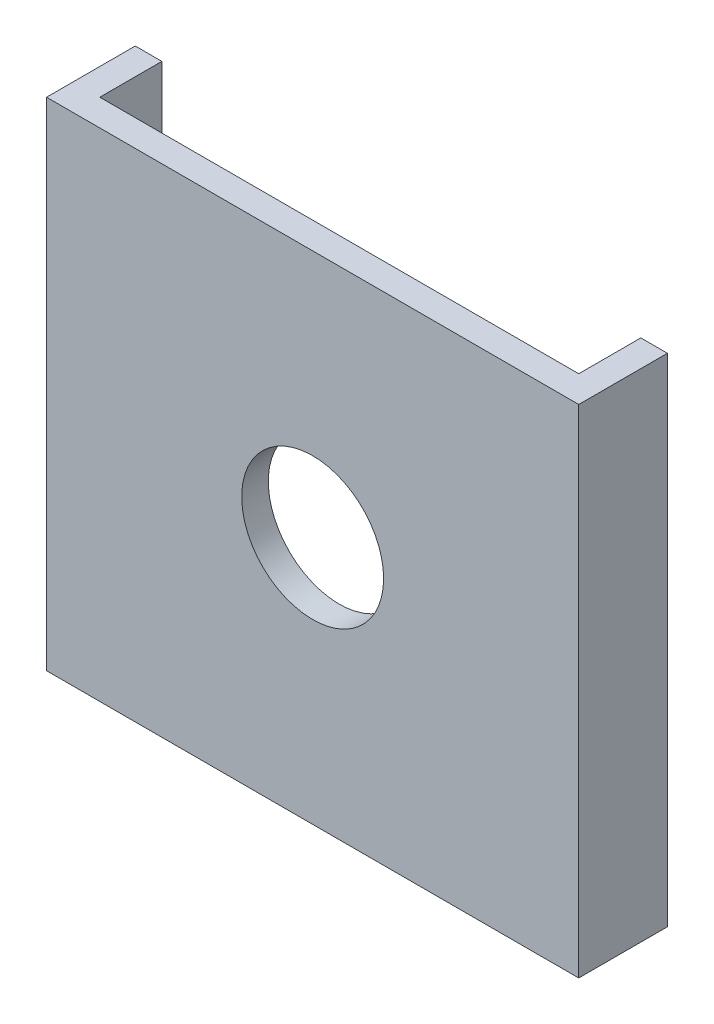
ISO-10303-21;
HEADER;
FILE_DESCRIPTION(('STEP AP214'),'2;1');
FILE_NAME('part.step','',(''),(''),'','','');
FILE_SCHEMA(('AUTOMOTIVE_DESIGN { 1 0 10303 214 1 1 1 1 }'));
ENDSEC;
DATA;
#1=APPLICATION_CONTEXT('core data for automotive mechanical design processes');
#2=APPLICATION_PROTOCOL_DEFINITION('international standard','automotive_design',2000,#1);
#3=PRODUCT_CONTEXT('',#1,'mechanical');
#4=PRODUCT('Part','Part','',(#3));
#5=PRODUCT_RELATED_PRODUCT_CATEGORY('part','',(#4));
#6=PRODUCT_DEFINITION_FORMATION('','',#4);
#7=PRODUCT_DEFINITION_CONTEXT('part definition',#1,'design');
#8=PRODUCT_DEFINITION('design','',#6,#7);
#9=PRODUCT_DEFINITION_SHAPE('','',#8);
#10=(LENGTH_UNIT() NAMED_UNIT(*) SI_UNIT(.MILLI.,.METRE.));
#11=(NAMED_UNIT(*) PLANE_ANGLE_UNIT() SI_UNIT($,.RADIAN.));
#12=(NAMED_UNIT(*) SI_UNIT($,.STERADIAN.) SOLID_ANGLE_UNIT());
#13=UNCERTAINTY_MEASURE_WITH_UNIT(LENGTH_MEASURE(1.E-05),#10,'distance_accuracy_value','');
#14=(GEOMETRIC_REPRESENTATION_CONTEXT(3) GLOBAL_UNCERTAINTY_ASSIGNED_CONTEXT((#13)) GLOBAL_UNIT_ASSIGNED_CONTEXT((#10,
#11,#12)) REPRESENTATION_CONTEXT('',''));
#15=CARTESIAN_POINT('',(0.,0.,0.));
#16=DIRECTION('',(0.,0.,1.));
#17=DIRECTION('',(1.,0.,0.));
#18=AXIS2_PLACEMENT_3D('',#15,#16,#17);
#19=CARTESIAN_POINT('',(-13.5,9.,-5.));
#20=DIRECTION('',(0.,-1.,0.));
#21=DIRECTION('',(0.,0.,-1.));
#22=AXIS2_PLACEMENT_3D('',#19,#20,#21);
#23=PLANE('',#22);
#24=DIRECTION('',(0.,0.,1.));
#25=VECTOR('',#24,1.);
#26=CARTESIAN_POINT('',(-15.,9.,-5.));
#27=LINE('',#26,#25);
#28=CARTESIAN_POINT('',(-15.,9.,-8.));
#29=VERTEX_POINT('',#28);
#30=CARTESIAN_POINT('',(-15.,9.,-5.));
#31=VERTEX_POINT('',#30);
#32=EDGE_CURVE('E110',#29,#31,#27,.T.);
#33=ORIENTED_EDGE('',*,*,#32,.F.);
#34=DIRECTION('',(-1.,0.,0.));
#35=VECTOR('',#34,1.);
#36=CARTESIAN_POINT('',(-13.5,9.,-8.));
#37=LINE('',#36,#35);
#38=CARTESIAN_POINT('',(-13.5,9.,-8.));
#39=VERTEX_POINT('',#38);
#40=EDGE_CURVE('E12',#39,#29,#37,.T.);
#41=ORIENTED_EDGE('',*,*,#40,.F.);
#42=DIRECTION('',(0.,0.,1.));
#43=VECTOR('',#42,1.);
#44=CARTESIAN_POINT('',(-13.5,9.,-5.));
#45=LINE('',#44,#43);
#46=CARTESIAN_POINT('',(-13.5,9.,-5.));
#47=VERTEX_POINT('',#46);
#48=EDGE_CURVE('E103',#39,#47,#45,.T.);
#49=ORIENTED_EDGE('',*,*,#48,.T.);
#50=DIRECTION('',(-1.,0.,0.));
#51=VECTOR('',#50,1.);
#52=CARTESIAN_POINT('',(-13.5,9.,-5.));
#53=LINE('',#52,#51);
#54=EDGE_CURVE('E48',#47,#31,#53,.T.);
#55=ORIENTED_EDGE('',*,*,#54,.T.);
#56=EDGE_LOOP('',(#33,#41,#49,#55));
#57=FACE_BOUND('',#56,.T.);
#58=ADVANCED_FACE('F45',(#57),#23,.T.);
#59=CARTESIAN_POINT('',(-13.5,14.,-8.));
#60=DIRECTION('',(-1.,0.,0.));
#61=DIRECTION('',(0.,0.,1.));
#62=AXIS2_PLACEMENT_3D('',#59,#60,#61);
#63=CYLINDRICAL_SURFACE('',#62,5.);
#64=CARTESIAN_POINT('',(-15.,14.,-8.));
#65=DIRECTION('',(-1.,0.,0.));
#66=DIRECTION('',(0.,0.,1.));
#67=AXIS2_PLACEMENT_3D('',#64,#65,#66);
#68=CIRCLE('',#67,5.);
#69=CARTESIAN_POINT('',(-15.,19.,-8.));
#70=VERTEX_POINT('',#69);
#71=EDGE_CURVE('E105',#70,#29,#68,.T.);
#72=ORIENTED_EDGE('',*,*,#71,.F.);
#73=DIRECTION('',(-1.,0.,0.));
#74=VECTOR('',#73,1.);
#75=CARTESIAN_POINT('',(-13.5,19.,-8.));
#76=LINE('',#75,#74);
#77=CARTESIAN_POINT('',(-13.5,19.,-8.));
#78=VERTEX_POINT('',#77);
#79=EDGE_CURVE('E54',#78,#70,#76,.T.);
#80=ORIENTED_EDGE('',*,*,#79,.F.);
#81=CARTESIAN_POINT('',(-13.5,14.,-8.));
#82=DIRECTION('',(-1.,0.,0.));
#83=DIRECTION('',(0.,0.,1.));
#84=AXIS2_PLACEMENT_3D('',#81,#82,#83);
#85=CIRCLE('',#84,5.);
#86=EDGE_CURVE('E100',#78,#39,#85,.T.);
#87=ORIENTED_EDGE('',*,*,#86,.T.);
#88=ORIENTED_EDGE('',*,*,#40,.T.);
#89=EDGE_LOOP('',(#72,#80,#87,#88));
#90=FACE_BOUND('',#89,.T.);
#91=ADVANCED_FACE('F121',(#90),#63,.T.);
#92=CARTESIAN_POINT('',(-13.5,19.,-8.));
#93=DIRECTION('',(0.,1.,0.));
#94=DIRECTION('',(0.,0.,1.));
#95=AXIS2_PLACEMENT_3D('',#92,#93,#94);
#96=PLANE('',#95);
#97=DIRECTION('',(0.,0.,-1.));
#98=VECTOR('',#97,1.);
#99=CARTESIAN_POINT('',(-15.,19.,-8.));
#100=LINE('',#99,#98);
#101=CARTESIAN_POINT('',(-15.,19.,-5.));
#102=VERTEX_POINT('',#101);
#103=EDGE_CURVE('E95',#102,#70,#100,.T.);
#104=ORIENTED_EDGE('',*,*,#103,.F.);
#105=DIRECTION('',(-1.,0.,0.));
#106=VECTOR('',#105,1.);
#107=CARTESIAN_POINT('',(-13.5,19.,-5.));
#108=LINE('',#107,#106);
#109=CARTESIAN_POINT('',(-13.5,19.,-5.));
#110=VERTEX_POINT('',#109);
#111=EDGE_CURVE('E90',#110,#102,#108,.T.);
#112=ORIENTED_EDGE('',*,*,#111,.F.);
#113=DIRECTION('',(0.,0.,-1.));
#114=VECTOR('',#113,1.);
#115=CARTESIAN_POINT('',(-13.5,19.,-8.));
#116=LINE('',#115,#114);
#117=EDGE_CURVE('E93',#110,#78,#116,.T.);
#118=ORIENTED_EDGE('',*,*,#117,.T.);
#119=ORIENTED_EDGE('',*,*,#79,.T.);
#120=EDGE_LOOP('',(#104,#112,#118,#119));
#121=FACE_BOUND('',#120,.T.);
#122=ADVANCED_FACE('F92',(#121),#96,.T.);
#123=CARTESIAN_POINT('',(-13.5,19.,-5.));
#124=DIRECTION('',(0.,0.,1.));
#125=DIRECTION('',(1.,0.,0.));
#126=AXIS2_PLACEMENT_3D('',#123,#124,#125);
#127=PLANE('',#126);
#128=DIRECTION('',(0.,1.,0.));
#129=VECTOR('',#128,1.);
#130=CARTESIAN_POINT('',(-15.,19.,-5.));
#131=LINE('',#130,#129);
#132=EDGE_CURVE('E113',#31,#102,#131,.T.);
#133=ORIENTED_EDGE('',*,*,#132,.F.);
#134=ORIENTED_EDGE('',*,*,#54,.F.);
#135=DIRECTION('',(0.,1.,0.));
#136=VECTOR('',#135,1.);
#137=CARTESIAN_POINT('',(-13.5,19.,-5.));
#138=LINE('',#137,#136);
#139=EDGE_CURVE('E99',#47,#110,#138,.T.);
#140=ORIENTED_EDGE('',*,*,#139,.T.);
#141=ORIENTED_EDGE('',*,*,#111,.T.);
#142=EDGE_LOOP('',(#133,#134,#140,#141));
#143=FACE_BOUND('',#142,.T.);
#144=ADVANCED_FACE('F102',(#143),#127,.T.);
#145=CARTESIAN_POINT('',(-13.5,14.,-8.));
#146=DIRECTION('',(-1.,0.,0.));
#147=DIRECTION('',(0.,0.,1.));
#148=AXIS2_PLACEMENT_3D('',#145,#146,#147);
#149=PLANE('',#148);
#150=CARTESIAN_POINT('',(-13.5,14.,-8.));
#151=DIRECTION('',(1.,0.,0.));
#152=DIRECTION('',(0.,0.,-1.));
#153=AXIS2_PLACEMENT_3D('',#150,#151,#152);
#154=CIRCLE('',#153,1.55);
#155=CARTESIAN_POINT('',(-13.5,14.,-9.55));
#156=VERTEX_POINT('',#155);
#157=EDGE_CURVE('E151',#156,#156,#154,.T.);
#158=ORIENTED_EDGE('',*,*,#157,.F.);
#159=EDGE_LOOP('',(#158));
#160=FACE_BOUND('',#159,.T.);
#161=ORIENTED_EDGE('',*,*,#48,.F.);
#162=ORIENTED_EDGE('',*,*,#86,.F.);
#163=ORIENTED_EDGE('',*,*,#117,.F.);
#164=ORIENTED_EDGE('',*,*,#139,.F.);
#165=EDGE_LOOP('',(#161,#162,#163,#164));
#166=FACE_BOUND('',#165,.T.);
#167=ADVANCED_FACE('F98',(#160,#166),#149,.F.);
#168=CARTESIAN_POINT('',(-15.,14.,-8.));
#169=DIRECTION('',(-1.,0.,0.));
#170=DIRECTION('',(0.,0.,1.));
#171=AXIS2_PLACEMENT_3D('',#168,#169,#170);
#172=PLANE('',#171);
#173=CARTESIAN_POINT('',(-15.,14.,-8.));
#174=DIRECTION('',(1.,0.,0.));
#175=DIRECTION('',(0.,0.,-1.));
#176=AXIS2_PLACEMENT_3D('',#173,#174,#175);
#177=CIRCLE('',#176,1.55);
#178=CARTESIAN_POINT('',(-15.,14.,-9.55));
#179=VERTEX_POINT('',#178);
#180=EDGE_CURVE('E114',#179,#179,#177,.T.);
#181=ORIENTED_EDGE('',*,*,#180,.T.);
#182=EDGE_LOOP('',(#181));
#183=FACE_BOUND('',#182,.T.);
#184=ORIENTED_EDGE('',*,*,#32,.T.);
#185=ORIENTED_EDGE('',*,*,#132,.T.);
#186=ORIENTED_EDGE('',*,*,#103,.T.);
#187=ORIENTED_EDGE('',*,*,#71,.T.);
#188=EDGE_LOOP('',(#184,#185,#186,#187));
#189=FACE_BOUND('',#188,.T.);
#190=ADVANCED_FACE('F120',(#183,#189),#172,.T.);
#191=CARTESIAN_POINT('',(-15.,14.,-8.));
#192=DIRECTION('',(1.,0.,0.));
#193=DIRECTION('',(0.,0.,-1.));
#194=AXIS2_PLACEMENT_3D('',#191,#192,#193);
#195=CYLINDRICAL_SURFACE('',#194,1.55);
#196=ORIENTED_EDGE('',*,*,#180,.F.);
#197=EDGE_LOOP('',(#196));
#198=FACE_BOUND('',#197,.T.);
#199=ORIENTED_EDGE('',*,*,#157,.T.);
#200=EDGE_LOOP('',(#199));
#201=FACE_BOUND('',#200,.T.);
#202=ADVANCED_FACE('F139',(#198,#201),#195,.F.);
#203=CLOSED_SHELL('',(#58,#91,#122,#144,#167,#190,#202));
#204=MANIFOLD_SOLID_BREP('B2',#203);
#205=CARTESIAN_POINT('',(-15.,28.,-5.));
#206=DIRECTION('',(1.,0.,0.));
#207=DIRECTION('',(0.,0.,-1.));
#208=AXIS2_PLACEMENT_3D('',#205,#206,#207);
#209=PLANE('',#208);
#210=DIRECTION('',(0.,0.,1.));
#211=VECTOR('',#210,1.);
#212=CARTESIAN_POINT('',(-15.,0.,-5.));
#213=LINE('',#212,#211);
#214=CARTESIAN_POINT('',(-15.,0.,-5.));
#215=VERTEX_POINT('',#214);
#216=CARTESIAN_POINT('',(-15.,0.,0.));
#217=VERTEX_POINT('',#216);
#218=EDGE_CURVE('E286',#215,#217,#213,.T.);
#219=ORIENTED_EDGE('',*,*,#218,.T.);
#220=DIRECTION('',(0.,-1.,0.));
#221=VECTOR('',#220,1.);
#222=CARTESIAN_POINT('',(-15.,28.,0.));
#223=LINE('',#222,#221);
#224=CARTESIAN_POINT('',(-15.,28.,0.));
#225=VERTEX_POINT('',#224);
#226=EDGE_CURVE('E43',#225,#217,#223,.T.);
#227=ORIENTED_EDGE('',*,*,#226,.F.);
#228=DIRECTION('',(0.,0.,1.));
#229=VECTOR('',#228,1.);
#230=CARTESIAN_POINT('',(-15.,28.,-5.));
#231=LINE('',#230,#229);
#232=CARTESIAN_POINT('',(-15.,28.,-5.));
#233=VERTEX_POINT('',#232);
#234=EDGE_CURVE('E301',#233,#225,#231,.T.);
#235=ORIENTED_EDGE('',*,*,#234,.F.);
#236=DIRECTION('',(0.,-1.,0.));
#237=VECTOR('',#236,1.);
#238=CARTESIAN_POINT('',(-15.,28.,-5.));
#239=LINE('',#238,#237);
#240=EDGE_CURVE('E282',#233,#215,#239,.T.);
#241=ORIENTED_EDGE('',*,*,#240,.T.);
#242=EDGE_LOOP('',(#219,#227,#235,#241));
#243=FACE_BOUND('',#242,.T.);
#244=ADVANCED_FACE('F190',(#243),#209,.F.);
#245=CARTESIAN_POINT('',(-15.,28.,0.));
#246=DIRECTION('',(0.,0.,-1.));
#247=DIRECTION('',(-1.,0.,0.));
#248=AXIS2_PLACEMENT_3D('',#245,#246,#247);
#249=PLANE('',#248);
#250=CARTESIAN_POINT('',(0.,14.,0.));
#251=DIRECTION('',(0.,0.,1.));
#252=DIRECTION('',(1.,0.,0.));
#253=AXIS2_PLACEMENT_3D('',#250,#251,#252);
#254=CIRCLE('',#253,4.);
#255=CARTESIAN_POINT('',(4.,14.,0.));
#256=VERTEX_POINT('',#255);
#257=EDGE_CURVE('E334',#256,#256,#254,.T.);
#258=ORIENTED_EDGE('',*,*,#257,.F.);
#259=EDGE_LOOP('',(#258));
#260=FACE_BOUND('',#259,.T.);
#261=DIRECTION('',(1.,0.,0.));
#262=VECTOR('',#261,1.);
#263=CARTESIAN_POINT('',(-15.,0.,0.));
#264=LINE('',#263,#262);
#265=CARTESIAN_POINT('',(15.,0.,0.));
#266=VERTEX_POINT('',#265);
#267=EDGE_CURVE('E289',#217,#266,#264,.T.);
#268=ORIENTED_EDGE('',*,*,#267,.T.);
#269=DIRECTION('',(0.,-1.,0.));
#270=VECTOR('',#269,1.);
#271=CARTESIAN_POINT('',(15.,28.,0.));
#272=LINE('',#271,#270);
#273=CARTESIAN_POINT('',(15.,28.,0.));
#274=VERTEX_POINT('',#273);
#275=EDGE_CURVE('E198',#274,#266,#272,.T.);
#276=ORIENTED_EDGE('',*,*,#275,.F.);
#277=DIRECTION('',(1.,0.,0.));
#278=VECTOR('',#277,1.);
#279=CARTESIAN_POINT('',(-15.,28.,0.));
#280=LINE('',#279,#278);
#281=EDGE_CURVE('E249',#225,#274,#280,.T.);
#282=ORIENTED_EDGE('',*,*,#281,.F.);
#283=ORIENTED_EDGE('',*,*,#226,.T.);
#284=EDGE_LOOP('',(#268,#276,#282,#283));
#285=FACE_BOUND('',#284,.T.);
#286=ADVANCED_FACE('F347',(#260,#285),#249,.F.);
#287=CARTESIAN_POINT('',(15.,28.,0.));
#288=DIRECTION('',(-1.,0.,0.));
#289=DIRECTION('',(0.,0.,1.));
#290=AXIS2_PLACEMENT_3D('',#287,#288,#289);
#291=PLANE('',#290);
#292=DIRECTION('',(0.,0.,-1.));
#293=VECTOR('',#292,1.);
#294=CARTESIAN_POINT('',(15.,0.,0.));
#295=LINE('',#294,#293);
#296=CARTESIAN_POINT('',(15.,0.,-5.));
#297=VERTEX_POINT('',#296);
#298=EDGE_CURVE('E292',#266,#297,#295,.T.);
#299=ORIENTED_EDGE('',*,*,#298,.T.);
#300=DIRECTION('',(0.,-1.,0.));
#301=VECTOR('',#300,1.);
#302=CARTESIAN_POINT('',(15.,28.,-5.));
#303=LINE('',#302,#301);
#304=CARTESIAN_POINT('',(15.,28.,-5.));
#305=VERTEX_POINT('',#304);
#306=EDGE_CURVE('E308',#305,#297,#303,.T.);
#307=ORIENTED_EDGE('',*,*,#306,.F.);
#308=DIRECTION('',(0.,0.,-1.));
#309=VECTOR('',#308,1.);
#310=CARTESIAN_POINT('',(15.,28.,0.));
#311=LINE('',#310,#309);
#312=EDGE_CURVE('E316',#274,#305,#311,.T.);
#313=ORIENTED_EDGE('',*,*,#312,.F.);
#314=ORIENTED_EDGE('',*,*,#275,.T.);
#315=EDGE_LOOP('',(#299,#307,#313,#314));
#316=FACE_BOUND('',#315,.T.);
#317=ADVANCED_FACE('F314',(#316),#291,.F.);
#318=CARTESIAN_POINT('',(13.5,28.,-5.));
#319=DIRECTION('',(0.,0.,1.));
#320=DIRECTION('',(1.,0.,0.));
#321=AXIS2_PLACEMENT_3D('',#318,#319,#320);
#322=PLANE('',#321);
#323=DIRECTION('',(-1.,0.,0.));
#324=VECTOR('',#323,1.);
#325=CARTESIAN_POINT('',(13.5,0.,-5.));
#326=LINE('',#325,#324);
#327=CARTESIAN_POINT('',(13.5,0.,-5.));
#328=VERTEX_POINT('',#327);
#329=EDGE_CURVE('E294',#297,#328,#326,.T.);
#330=ORIENTED_EDGE('',*,*,#329,.T.);
#331=DIRECTION('',(0.,-1.,0.));
#332=VECTOR('',#331,1.);
#333=CARTESIAN_POINT('',(13.5,28.,-5.));
#334=LINE('',#333,#332);
#335=CARTESIAN_POINT('',(13.5,28.,-5.));
#336=VERTEX_POINT('',#335);
#337=EDGE_CURVE('E305',#336,#328,#334,.T.);
#338=ORIENTED_EDGE('',*,*,#337,.F.);
#339=DIRECTION('',(-1.,0.,0.));
#340=VECTOR('',#339,1.);
#341=CARTESIAN_POINT('',(13.5,28.,-5.));
#342=LINE('',#341,#340);
#343=EDGE_CURVE('E328',#305,#336,#342,.T.);
#344=ORIENTED_EDGE('',*,*,#343,.F.);
#345=ORIENTED_EDGE('',*,*,#306,.T.);
#346=EDGE_LOOP('',(#330,#338,#344,#345));
#347=FACE_BOUND('',#346,.T.);
#348=ADVANCED_FACE('F324',(#347),#322,.F.);
#349=CARTESIAN_POINT('',(13.5,28.,-5.));
#350=DIRECTION('',(1.,0.,0.));
#351=DIRECTION('',(0.,0.,-1.));
#352=AXIS2_PLACEMENT_3D('',#349,#350,#351);
#353=PLANE('',#352);
#354=DIRECTION('',(0.,0.,1.));
#355=VECTOR('',#354,1.);
#356=CARTESIAN_POINT('',(13.5,0.,-5.));
#357=LINE('',#356,#355);
#358=CARTESIAN_POINT('',(13.5,0.,-1.5));
#359=VERTEX_POINT('',#358);
#360=EDGE_CURVE('E296',#328,#359,#357,.T.);
#361=ORIENTED_EDGE('',*,*,#360,.T.);
#362=DIRECTION('',(0.,-1.,0.));
#363=VECTOR('',#362,1.);
#364=CARTESIAN_POINT('',(13.5,28.,-1.5));
#365=LINE('',#364,#363);
#366=CARTESIAN_POINT('',(13.5,28.,-1.5));
#367=VERTEX_POINT('',#366);
#368=EDGE_CURVE('E277',#367,#359,#365,.T.);
#369=ORIENTED_EDGE('',*,*,#368,.F.);
#370=DIRECTION('',(0.,0.,1.));
#371=VECTOR('',#370,1.);
#372=CARTESIAN_POINT('',(13.5,28.,-5.));
#373=LINE('',#372,#371);
#374=EDGE_CURVE('E268',#336,#367,#373,.T.);
#375=ORIENTED_EDGE('',*,*,#374,.F.);
#376=ORIENTED_EDGE('',*,*,#337,.T.);
#377=EDGE_LOOP('',(#361,#369,#375,#376));
#378=FACE_BOUND('',#377,.T.);
#379=ADVANCED_FACE('F327',(#378),#353,.F.);
#380=CARTESIAN_POINT('',(13.5,28.,-1.5));
#381=DIRECTION('',(0.,0.,1.));
#382=DIRECTION('',(1.,0.,0.));
#383=AXIS2_PLACEMENT_3D('',#380,#381,#382);
#384=PLANE('',#383);
#385=CARTESIAN_POINT('',(0.,14.,-1.5));
#386=DIRECTION('',(0.,0.,1.));
#387=DIRECTION('',(1.,0.,0.));
#388=AXIS2_PLACEMENT_3D('',#385,#386,#387);
#389=CIRCLE('',#388,4.);
#390=CARTESIAN_POINT('',(4.,14.,-1.5));
#391=VERTEX_POINT('',#390);
#392=EDGE_CURVE('E290',#391,#391,#389,.T.);
#393=ORIENTED_EDGE('',*,*,#392,.T.);
#394=EDGE_LOOP('',(#393));
#395=FACE_BOUND('',#394,.T.);
#396=DIRECTION('',(-1.,0.,0.));
#397=VECTOR('',#396,1.);
#398=CARTESIAN_POINT('',(13.5,0.,-1.5));
#399=LINE('',#398,#397);
#400=CARTESIAN_POINT('',(-13.5,0.,-1.5));
#401=VERTEX_POINT('',#400);
#402=EDGE_CURVE('E276',#359,#401,#399,.T.);
#403=ORIENTED_EDGE('',*,*,#402,.T.);
#404=DIRECTION('',(0.,-1.,0.));
#405=VECTOR('',#404,1.);
#406=CARTESIAN_POINT('',(-13.5,28.,-1.5));
#407=LINE('',#406,#405);
#408=CARTESIAN_POINT('',(-13.5,28.,-1.5));
#409=VERTEX_POINT('',#408);
#410=EDGE_CURVE('E273',#409,#401,#407,.T.);
#411=ORIENTED_EDGE('',*,*,#410,.F.);
#412=DIRECTION('',(-1.,0.,0.));
#413=VECTOR('',#412,1.);
#414=CARTESIAN_POINT('',(13.5,28.,-1.5));
#415=LINE('',#414,#413);
#416=EDGE_CURVE('E262',#367,#409,#415,.T.);
#417=ORIENTED_EDGE('',*,*,#416,.F.);
#418=ORIENTED_EDGE('',*,*,#368,.T.);
#419=EDGE_LOOP('',(#403,#411,#417,#418));
#420=FACE_BOUND('',#419,.T.);
#421=ADVANCED_FACE('F274',(#395,#420),#384,.F.);
#422=CARTESIAN_POINT('',(-13.5,28.,-1.5));
#423=DIRECTION('',(-1.,0.,0.));
#424=DIRECTION('',(0.,0.,1.));
#425=AXIS2_PLACEMENT_3D('',#422,#423,#424);
#426=PLANE('',#425);
#427=DIRECTION('',(0.,0.,-1.));
#428=VECTOR('',#427,1.);
#429=CARTESIAN_POINT('',(-13.5,0.,-1.5));
#430=LINE('',#429,#428);
#431=CARTESIAN_POINT('',(-13.5,0.,-5.));
#432=VERTEX_POINT('',#431);
#433=EDGE_CURVE('E235',#401,#432,#430,.T.);
#434=ORIENTED_EDGE('',*,*,#433,.T.);
#435=DIRECTION('',(0.,-1.,0.));
#436=VECTOR('',#435,1.);
#437=CARTESIAN_POINT('',(-13.5,28.,-5.));
#438=LINE('',#437,#436);
#439=CARTESIAN_POINT('',(-13.5,28.,-5.));
#440=VERTEX_POINT('',#439);
#441=EDGE_CURVE('E278',#440,#432,#438,.T.);
#442=ORIENTED_EDGE('',*,*,#441,.F.);
#443=DIRECTION('',(0.,0.,-1.));
#444=VECTOR('',#443,1.);
#445=CARTESIAN_POINT('',(-13.5,28.,-1.5));
#446=LINE('',#445,#444);
#447=EDGE_CURVE('E266',#409,#440,#446,.T.);
#448=ORIENTED_EDGE('',*,*,#447,.F.);
#449=ORIENTED_EDGE('',*,*,#410,.T.);
#450=EDGE_LOOP('',(#434,#442,#448,#449));
#451=FACE_BOUND('',#450,.T.);
#452=ADVANCED_FACE('F280',(#451),#426,.F.);
#453=CARTESIAN_POINT('',(-13.5,28.,-5.));
#454=DIRECTION('',(0.,0.,1.));
#455=DIRECTION('',(1.,0.,0.));
#456=AXIS2_PLACEMENT_3D('',#453,#454,#455);
#457=PLANE('',#456);
#458=DIRECTION('',(-1.,0.,0.));
#459=VECTOR('',#458,1.);
#460=CARTESIAN_POINT('',(-13.5,0.,-5.));
#461=LINE('',#460,#459);
#462=EDGE_CURVE('E241',#432,#215,#461,.T.);
#463=ORIENTED_EDGE('',*,*,#462,.T.);
#464=ORIENTED_EDGE('',*,*,#240,.F.);
#465=DIRECTION('',(-1.,0.,0.));
#466=VECTOR('',#465,1.);
#467=CARTESIAN_POINT('',(-13.5,28.,-5.));
#468=LINE('',#467,#466);
#469=EDGE_CURVE('E206',#440,#233,#468,.T.);
#470=ORIENTED_EDGE('',*,*,#469,.F.);
#471=ORIENTED_EDGE('',*,*,#441,.T.);
#472=EDGE_LOOP('',(#463,#464,#470,#471));
#473=FACE_BOUND('',#472,.T.);
#474=ADVANCED_FACE('F352',(#473),#457,.F.);
#475=CARTESIAN_POINT('',(0.,28.,0.));
#476=DIRECTION('',(0.,1.,0.));
#477=DIRECTION('',(0.,0.,1.));
#478=AXIS2_PLACEMENT_3D('',#475,#476,#477);
#479=PLANE('',#478);
#480=ORIENTED_EDGE('',*,*,#234,.T.);
#481=ORIENTED_EDGE('',*,*,#281,.T.);
#482=ORIENTED_EDGE('',*,*,#312,.T.);
#483=ORIENTED_EDGE('',*,*,#343,.T.);
#484=ORIENTED_EDGE('',*,*,#374,.T.);
#485=ORIENTED_EDGE('',*,*,#416,.T.);
#486=ORIENTED_EDGE('',*,*,#447,.T.);
#487=ORIENTED_EDGE('',*,*,#469,.T.);
#488=EDGE_LOOP('',(#480,#481,#482,#483,#484,#485,#486,#487));
#489=FACE_BOUND('',#488,.T.);
#490=ADVANCED_FACE('F264',(#489),#479,.T.);
#491=CARTESIAN_POINT('',(0.,0.,0.));
#492=DIRECTION('',(0.,1.,0.));
#493=DIRECTION('',(0.,0.,1.));
#494=AXIS2_PLACEMENT_3D('',#491,#492,#493);
#495=PLANE('',#494);
#496=ORIENTED_EDGE('',*,*,#218,.F.);
#497=ORIENTED_EDGE('',*,*,#462,.F.);
#498=ORIENTED_EDGE('',*,*,#433,.F.);
#499=ORIENTED_EDGE('',*,*,#402,.F.);
#500=ORIENTED_EDGE('',*,*,#360,.F.);
#501=ORIENTED_EDGE('',*,*,#329,.F.);
#502=ORIENTED_EDGE('',*,*,#298,.F.);
#503=ORIENTED_EDGE('',*,*,#267,.F.);
#504=EDGE_LOOP('',(#496,#497,#498,#499,#500,#501,#502,#503));
#505=FACE_BOUND('',#504,.T.);
#506=ADVANCED_FACE('F320',(#505),#495,.F.);
#507=CARTESIAN_POINT('',(0.,14.,-1.5));
#508=DIRECTION('',(0.,0.,1.));
#509=DIRECTION('',(1.,0.,0.));
#510=AXIS2_PLACEMENT_3D('',#507,#508,#509);
#511=CYLINDRICAL_SURFACE('',#510,4.);
#512=ORIENTED_EDGE('',*,*,#392,.F.);
#513=EDGE_LOOP('',(#512));
#514=FACE_BOUND('',#513,.T.);
#515=ORIENTED_EDGE('',*,*,#257,.T.);
#516=EDGE_LOOP('',(#515));
#517=FACE_BOUND('',#516,.T.);
#518=ADVANCED_FACE('F341',(#514,#517),#511,.F.);
#519=CLOSED_SHELL('',(#244,#286,#317,#348,#379,#421,#452,#474,#490,#506,#518));
#520=MANIFOLD_SOLID_BREP('B6',#519);
#521=ADVANCED_BREP_SHAPE_REPRESENTATION('',(#18,#204,#520),#14);
#522=SHAPE_DEFINITION_REPRESENTATION(#9,#521);
ENDSEC;
END-ISO-10303-21;
